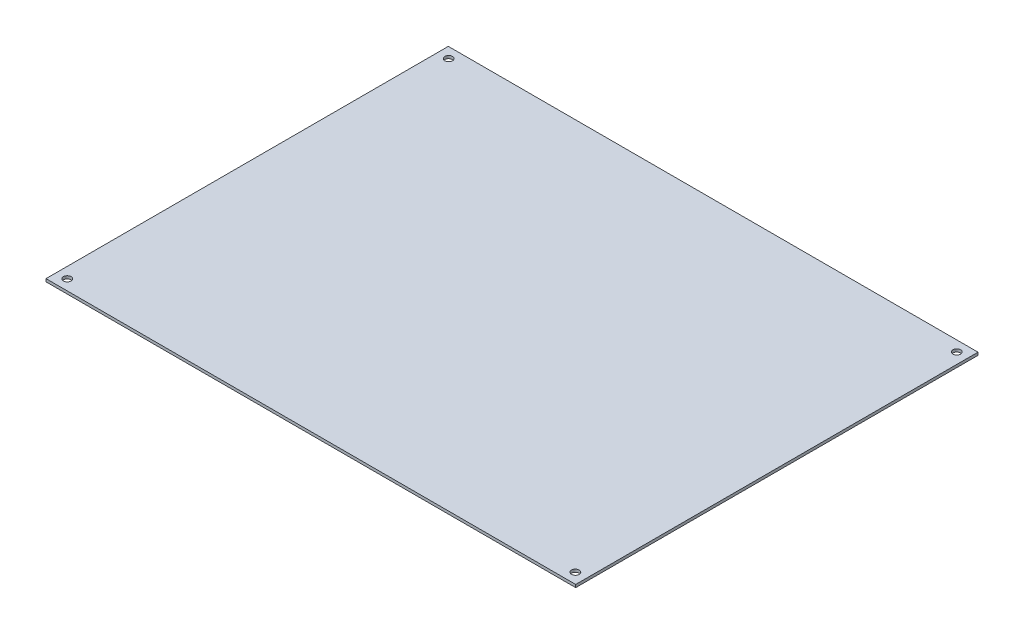
ISO-10303-21;
HEADER;
FILE_DESCRIPTION(('STEP AP214'),'2;1');
FILE_NAME('part.step','',(''),(''),'','','');
FILE_SCHEMA(('AUTOMOTIVE_DESIGN { 1 0 10303 214 1 1 1 1 }'));
ENDSEC;
DATA;
#1=APPLICATION_CONTEXT('core data for automotive mechanical design processes');
#2=APPLICATION_PROTOCOL_DEFINITION('international standard','automotive_design',2000,#1);
#3=PRODUCT_CONTEXT('',#1,'mechanical');
#4=PRODUCT('Part','Part','',(#3));
#5=PRODUCT_RELATED_PRODUCT_CATEGORY('part','',(#4));
#6=PRODUCT_DEFINITION_FORMATION('','',#4);
#7=PRODUCT_DEFINITION_CONTEXT('part definition',#1,'design');
#8=PRODUCT_DEFINITION('design','',#6,#7);
#9=PRODUCT_DEFINITION_SHAPE('','',#8);
#10=(LENGTH_UNIT() NAMED_UNIT(*) SI_UNIT(.MILLI.,.METRE.));
#11=(NAMED_UNIT(*) PLANE_ANGLE_UNIT() SI_UNIT($,.RADIAN.));
#12=(NAMED_UNIT(*) SI_UNIT($,.STERADIAN.) SOLID_ANGLE_UNIT());
#13=UNCERTAINTY_MEASURE_WITH_UNIT(LENGTH_MEASURE(1.E-05),#10,'distance_accuracy_value','');
#14=(GEOMETRIC_REPRESENTATION_CONTEXT(3) GLOBAL_UNCERTAINTY_ASSIGNED_CONTEXT((#13)) GLOBAL_UNIT_ASSIGNED_CONTEXT((#10,
#11,#12)) REPRESENTATION_CONTEXT('',''));
#15=CARTESIAN_POINT('',(0.,0.,0.));
#16=DIRECTION('',(0.,0.,1.));
#17=DIRECTION('',(1.,0.,0.));
#18=AXIS2_PLACEMENT_3D('',#15,#16,#17);
#19=CARTESIAN_POINT('',(-190.25,2.,-144.5));
#20=DIRECTION('',(1.,0.,0.));
#21=DIRECTION('',(0.,0.,-1.));
#22=AXIS2_PLACEMENT_3D('',#19,#20,#21);
#23=PLANE('',#22);
#24=DIRECTION('',(0.,0.,1.));
#25=VECTOR('',#24,1.);
#26=CARTESIAN_POINT('',(-190.25,0.,-144.5));
#27=LINE('',#26,#25);
#28=CARTESIAN_POINT('',(-190.25,0.,-144.5));
#29=VERTEX_POINT('',#28);
#30=CARTESIAN_POINT('',(-190.25,0.,144.5));
#31=VERTEX_POINT('',#30);
#32=EDGE_CURVE('E96',#29,#31,#27,.T.);
#33=ORIENTED_EDGE('',*,*,#32,.T.);
#34=DIRECTION('',(0.,-1.,0.));
#35=VECTOR('',#34,1.);
#36=CARTESIAN_POINT('',(-190.25,2.,144.5));
#37=LINE('',#36,#35);
#38=CARTESIAN_POINT('',(-190.25,2.,144.5));
#39=VERTEX_POINT('',#38);
#40=EDGE_CURVE('E11',#39,#31,#37,.T.);
#41=ORIENTED_EDGE('',*,*,#40,.F.);
#42=DIRECTION('',(0.,0.,1.));
#43=VECTOR('',#42,1.);
#44=CARTESIAN_POINT('',(-190.25,2.,-144.5));
#45=LINE('',#44,#43);
#46=CARTESIAN_POINT('',(-190.25,2.,-144.5));
#47=VERTEX_POINT('',#46);
#48=EDGE_CURVE('E84',#47,#39,#45,.T.);
#49=ORIENTED_EDGE('',*,*,#48,.F.);
#50=DIRECTION('',(0.,-1.,0.));
#51=VECTOR('',#50,1.);
#52=CARTESIAN_POINT('',(-190.25,2.,-144.5));
#53=LINE('',#52,#51);
#54=EDGE_CURVE('E92',#47,#29,#53,.T.);
#55=ORIENTED_EDGE('',*,*,#54,.T.);
#56=EDGE_LOOP('',(#33,#41,#49,#55));
#57=FACE_BOUND('',#56,.T.);
#58=ADVANCED_FACE('F33',(#57),#23,.F.);
#59=CARTESIAN_POINT('',(-190.25,2.,144.5));
#60=DIRECTION('',(0.,0.,-1.));
#61=DIRECTION('',(-1.,0.,0.));
#62=AXIS2_PLACEMENT_3D('',#59,#60,#61);
#63=PLANE('',#62);
#64=DIRECTION('',(1.,0.,0.));
#65=VECTOR('',#64,1.);
#66=CARTESIAN_POINT('',(-190.25,0.,144.5));
#67=LINE('',#66,#65);
#68=CARTESIAN_POINT('',(190.25,0.,144.5));
#69=VERTEX_POINT('',#68);
#70=EDGE_CURVE('E88',#31,#69,#67,.T.);
#71=ORIENTED_EDGE('',*,*,#70,.T.);
#72=DIRECTION('',(0.,-1.,0.));
#73=VECTOR('',#72,1.);
#74=CARTESIAN_POINT('',(190.25,2.,144.5));
#75=LINE('',#74,#73);
#76=CARTESIAN_POINT('',(190.25,2.,144.5));
#77=VERTEX_POINT('',#76);
#78=EDGE_CURVE('E41',#77,#69,#75,.T.);
#79=ORIENTED_EDGE('',*,*,#78,.F.);
#80=DIRECTION('',(1.,0.,0.));
#81=VECTOR('',#80,1.);
#82=CARTESIAN_POINT('',(-190.25,2.,144.5));
#83=LINE('',#82,#81);
#84=EDGE_CURVE('E79',#39,#77,#83,.T.);
#85=ORIENTED_EDGE('',*,*,#84,.F.);
#86=ORIENTED_EDGE('',*,*,#40,.T.);
#87=EDGE_LOOP('',(#71,#79,#85,#86));
#88=FACE_BOUND('',#87,.T.);
#89=ADVANCED_FACE('F87',(#88),#63,.F.);
#90=CARTESIAN_POINT('',(190.25,2.,-144.5));
#91=DIRECTION('',(-1.,0.,0.));
#92=DIRECTION('',(0.,0.,1.));
#93=AXIS2_PLACEMENT_3D('',#90,#91,#92);
#94=PLANE('',#93);
#95=DIRECTION('',(0.,0.,-1.));
#96=VECTOR('',#95,1.);
#97=CARTESIAN_POINT('',(190.25,0.,-144.5));
#98=LINE('',#97,#96);
#99=CARTESIAN_POINT('',(190.25,0.,-144.5));
#100=VERTEX_POINT('',#99);
#101=EDGE_CURVE('E66',#69,#100,#98,.T.);
#102=ORIENTED_EDGE('',*,*,#101,.T.);
#103=DIRECTION('',(0.,-1.,0.));
#104=VECTOR('',#103,1.);
#105=CARTESIAN_POINT('',(190.25,2.,-144.5));
#106=LINE('',#105,#104);
#107=CARTESIAN_POINT('',(190.25,2.,-144.5));
#108=VERTEX_POINT('',#107);
#109=EDGE_CURVE('E89',#108,#100,#106,.T.);
#110=ORIENTED_EDGE('',*,*,#109,.F.);
#111=DIRECTION('',(0.,0.,-1.));
#112=VECTOR('',#111,1.);
#113=CARTESIAN_POINT('',(190.25,2.,-144.5));
#114=LINE('',#113,#112);
#115=EDGE_CURVE('E82',#77,#108,#114,.T.);
#116=ORIENTED_EDGE('',*,*,#115,.F.);
#117=ORIENTED_EDGE('',*,*,#78,.T.);
#118=EDGE_LOOP('',(#102,#110,#116,#117));
#119=FACE_BOUND('',#118,.T.);
#120=ADVANCED_FACE('F90',(#119),#94,.F.);
#121=CARTESIAN_POINT('',(-190.25,2.,-144.5));
#122=DIRECTION('',(0.,0.,1.));
#123=DIRECTION('',(1.,0.,0.));
#124=AXIS2_PLACEMENT_3D('',#121,#122,#123);
#125=PLANE('',#124);
#126=DIRECTION('',(-1.,0.,0.));
#127=VECTOR('',#126,1.);
#128=CARTESIAN_POINT('',(-190.25,0.,-144.5));
#129=LINE('',#128,#127);
#130=EDGE_CURVE('E72',#100,#29,#129,.T.);
#131=ORIENTED_EDGE('',*,*,#130,.T.);
#132=ORIENTED_EDGE('',*,*,#54,.F.);
#133=DIRECTION('',(-1.,0.,0.));
#134=VECTOR('',#133,1.);
#135=CARTESIAN_POINT('',(-190.25,2.,-144.5));
#136=LINE('',#135,#134);
#137=EDGE_CURVE('E49',#108,#47,#136,.T.);
#138=ORIENTED_EDGE('',*,*,#137,.F.);
#139=ORIENTED_EDGE('',*,*,#109,.T.);
#140=EDGE_LOOP('',(#131,#132,#138,#139));
#141=FACE_BOUND('',#140,.T.);
#142=ADVANCED_FACE('F104',(#141),#125,.F.);
#143=CARTESIAN_POINT('',(0.,2.,0.));
#144=DIRECTION('',(0.,1.,0.));
#145=DIRECTION('',(0.,0.,1.));
#146=AXIS2_PLACEMENT_3D('',#143,#144,#145);
#147=PLANE('',#146);
#148=CARTESIAN_POINT('',(-182.5,2.,-137.));
#149=DIRECTION('',(0.,1.,0.));
#150=DIRECTION('',(0.,0.,1.));
#151=AXIS2_PLACEMENT_3D('',#148,#149,#150);
#152=CIRCLE('',#151,2.74999999999997);
#153=CARTESIAN_POINT('',(-182.5,2.,-134.25));
#154=VERTEX_POINT('',#153);
#155=EDGE_CURVE('E130',#154,#154,#152,.T.);
#156=ORIENTED_EDGE('',*,*,#155,.F.);
#157=EDGE_LOOP('',(#156));
#158=FACE_BOUND('',#157,.T.);
#159=CARTESIAN_POINT('',(-182.5,2.,137.));
#160=DIRECTION('',(0.,1.,0.));
#161=DIRECTION('',(0.,0.,1.));
#162=AXIS2_PLACEMENT_3D('',#159,#160,#161);
#163=CIRCLE('',#162,2.74999999999997);
#164=CARTESIAN_POINT('',(-182.5,2.,139.75));
#165=VERTEX_POINT('',#164);
#166=EDGE_CURVE('E124',#165,#165,#163,.T.);
#167=ORIENTED_EDGE('',*,*,#166,.F.);
#168=EDGE_LOOP('',(#167));
#169=FACE_BOUND('',#168,.T.);
#170=CARTESIAN_POINT('',(182.5,2.,137.));
#171=DIRECTION('',(0.,1.,0.));
#172=DIRECTION('',(0.,0.,1.));
#173=AXIS2_PLACEMENT_3D('',#170,#171,#172);
#174=CIRCLE('',#173,2.74999999999997);
#175=CARTESIAN_POINT('',(182.5,2.,139.75));
#176=VERTEX_POINT('',#175);
#177=EDGE_CURVE('E118',#176,#176,#174,.T.);
#178=ORIENTED_EDGE('',*,*,#177,.F.);
#179=EDGE_LOOP('',(#178));
#180=FACE_BOUND('',#179,.T.);
#181=CARTESIAN_POINT('',(182.5,2.,-137.));
#182=DIRECTION('',(0.,1.,0.));
#183=DIRECTION('',(0.,0.,1.));
#184=AXIS2_PLACEMENT_3D('',#181,#182,#183);
#185=CIRCLE('',#184,2.74999999999997);
#186=CARTESIAN_POINT('',(182.5,2.,-134.25));
#187=VERTEX_POINT('',#186);
#188=EDGE_CURVE('E112',#187,#187,#185,.T.);
#189=ORIENTED_EDGE('',*,*,#188,.F.);
#190=EDGE_LOOP('',(#189));
#191=FACE_BOUND('',#190,.T.);
#192=ORIENTED_EDGE('',*,*,#48,.T.);
#193=ORIENTED_EDGE('',*,*,#84,.T.);
#194=ORIENTED_EDGE('',*,*,#115,.T.);
#195=ORIENTED_EDGE('',*,*,#137,.T.);
#196=EDGE_LOOP('',(#192,#193,#194,#195));
#197=FACE_BOUND('',#196,.T.);
#198=ADVANCED_FACE('F80',(#158,#169,#180,#191,#197),#147,.T.);
#199=CARTESIAN_POINT('',(0.,0.,0.));
#200=DIRECTION('',(0.,1.,0.));
#201=DIRECTION('',(0.,0.,1.));
#202=AXIS2_PLACEMENT_3D('',#199,#200,#201);
#203=PLANE('',#202);
#204=CARTESIAN_POINT('',(-182.5,0.,-137.));
#205=DIRECTION('',(0.,1.,0.));
#206=DIRECTION('',(0.,0.,1.));
#207=AXIS2_PLACEMENT_3D('',#204,#205,#206);
#208=CIRCLE('',#207,2.75);
#209=CARTESIAN_POINT('',(-182.5,0.,-134.25));
#210=VERTEX_POINT('',#209);
#211=EDGE_CURVE('E127',#210,#210,#208,.T.);
#212=ORIENTED_EDGE('',*,*,#211,.T.);
#213=EDGE_LOOP('',(#212));
#214=FACE_BOUND('',#213,.T.);
#215=CARTESIAN_POINT('',(-182.5,0.,137.));
#216=DIRECTION('',(0.,1.,0.));
#217=DIRECTION('',(0.,0.,1.));
#218=AXIS2_PLACEMENT_3D('',#215,#216,#217);
#219=CIRCLE('',#218,2.75);
#220=CARTESIAN_POINT('',(-182.5,0.,139.75));
#221=VERTEX_POINT('',#220);
#222=EDGE_CURVE('E121',#221,#221,#219,.T.);
#223=ORIENTED_EDGE('',*,*,#222,.T.);
#224=EDGE_LOOP('',(#223));
#225=FACE_BOUND('',#224,.T.);
#226=CARTESIAN_POINT('',(182.5,0.,137.));
#227=DIRECTION('',(0.,1.,0.));
#228=DIRECTION('',(0.,0.,1.));
#229=AXIS2_PLACEMENT_3D('',#226,#227,#228);
#230=CIRCLE('',#229,2.75);
#231=CARTESIAN_POINT('',(182.5,0.,139.75));
#232=VERTEX_POINT('',#231);
#233=EDGE_CURVE('E115',#232,#232,#230,.T.);
#234=ORIENTED_EDGE('',*,*,#233,.T.);
#235=EDGE_LOOP('',(#234));
#236=FACE_BOUND('',#235,.T.);
#237=CARTESIAN_POINT('',(182.5,0.,-137.));
#238=DIRECTION('',(0.,1.,0.));
#239=DIRECTION('',(0.,0.,1.));
#240=AXIS2_PLACEMENT_3D('',#237,#238,#239);
#241=CIRCLE('',#240,2.75);
#242=CARTESIAN_POINT('',(182.5,0.,-134.25));
#243=VERTEX_POINT('',#242);
#244=EDGE_CURVE('E99',#243,#243,#241,.T.);
#245=ORIENTED_EDGE('',*,*,#244,.T.);
#246=EDGE_LOOP('',(#245));
#247=FACE_BOUND('',#246,.T.);
#248=ORIENTED_EDGE('',*,*,#32,.F.);
#249=ORIENTED_EDGE('',*,*,#130,.F.);
#250=ORIENTED_EDGE('',*,*,#101,.F.);
#251=ORIENTED_EDGE('',*,*,#70,.F.);
#252=EDGE_LOOP('',(#248,#249,#250,#251));
#253=FACE_BOUND('',#252,.T.);
#254=ADVANCED_FACE('F107',(#214,#225,#236,#247,#253),#203,.F.);
#255=CARTESIAN_POINT('',(182.5,2.,-137.));
#256=DIRECTION('',(0.,1.,0.));
#257=DIRECTION('',(0.,0.,1.));
#258=AXIS2_PLACEMENT_3D('',#255,#256,#257);
#259=CYLINDRICAL_SURFACE('',#258,2.74999999999999);
#260=ORIENTED_EDGE('',*,*,#244,.F.);
#261=EDGE_LOOP('',(#260));
#262=FACE_BOUND('',#261,.T.);
#263=ORIENTED_EDGE('',*,*,#188,.T.);
#264=EDGE_LOOP('',(#263));
#265=FACE_BOUND('',#264,.T.);
#266=ADVANCED_FACE('F145',(#262,#265),#259,.F.);
#267=CARTESIAN_POINT('',(182.5,2.,137.));
#268=DIRECTION('',(0.,1.,0.));
#269=DIRECTION('',(0.,0.,1.));
#270=AXIS2_PLACEMENT_3D('',#267,#268,#269);
#271=CYLINDRICAL_SURFACE('',#270,2.74999999999999);
#272=ORIENTED_EDGE('',*,*,#233,.F.);
#273=EDGE_LOOP('',(#272));
#274=FACE_BOUND('',#273,.T.);
#275=ORIENTED_EDGE('',*,*,#177,.T.);
#276=EDGE_LOOP('',(#275));
#277=FACE_BOUND('',#276,.T.);
#278=ADVANCED_FACE('F147',(#274,#277),#271,.F.);
#279=CARTESIAN_POINT('',(-182.5,2.,137.));
#280=DIRECTION('',(0.,1.,0.));
#281=DIRECTION('',(0.,0.,1.));
#282=AXIS2_PLACEMENT_3D('',#279,#280,#281);
#283=CYLINDRICAL_SURFACE('',#282,2.74999999999999);
#284=ORIENTED_EDGE('',*,*,#222,.F.);
#285=EDGE_LOOP('',(#284));
#286=FACE_BOUND('',#285,.T.);
#287=ORIENTED_EDGE('',*,*,#166,.T.);
#288=EDGE_LOOP('',(#287));
#289=FACE_BOUND('',#288,.T.);
#290=ADVANCED_FACE('F154',(#286,#289),#283,.F.);
#291=CARTESIAN_POINT('',(-182.5,2.,-137.));
#292=DIRECTION('',(0.,1.,0.));
#293=DIRECTION('',(0.,0.,1.));
#294=AXIS2_PLACEMENT_3D('',#291,#292,#293);
#295=CYLINDRICAL_SURFACE('',#294,2.74999999999999);
#296=ORIENTED_EDGE('',*,*,#211,.F.);
#297=EDGE_LOOP('',(#296));
#298=FACE_BOUND('',#297,.T.);
#299=ORIENTED_EDGE('',*,*,#155,.T.);
#300=EDGE_LOOP('',(#299));
#301=FACE_BOUND('',#300,.T.);
#302=ADVANCED_FACE('F134',(#298,#301),#295,.F.);
#303=CLOSED_SHELL('',(#58,#89,#120,#142,#198,#254,#266,#278,#290,#302));
#304=MANIFOLD_SOLID_BREP('B2',#303);
#305=ADVANCED_BREP_SHAPE_REPRESENTATION('',(#18,#304),#14);
#306=SHAPE_DEFINITION_REPRESENTATION(#9,#305);
ENDSEC;
END-ISO-10303-21;
